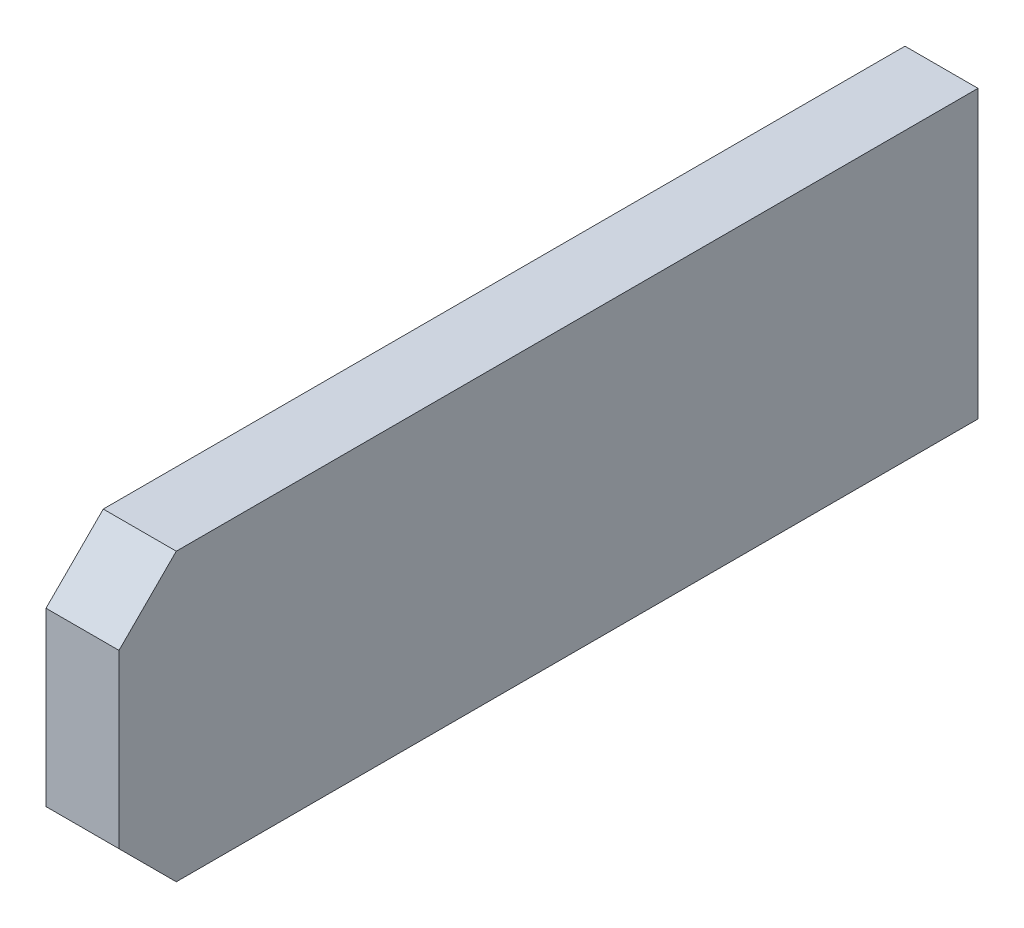
ISO-10303-21;
HEADER;
FILE_DESCRIPTION(('STEP AP214'),'2;1');
FILE_NAME('part.step','',(''),(''),'','','');
FILE_SCHEMA(('AUTOMOTIVE_DESIGN { 1 0 10303 214 1 1 1 1 }'));
ENDSEC;
DATA;
#1=APPLICATION_CONTEXT('core data for automotive mechanical design processes');
#2=APPLICATION_PROTOCOL_DEFINITION('international standard','automotive_design',2000,#1);
#3=PRODUCT_CONTEXT('',#1,'mechanical');
#4=PRODUCT('Part','Part','',(#3));
#5=PRODUCT_RELATED_PRODUCT_CATEGORY('part','',(#4));
#6=PRODUCT_DEFINITION_FORMATION('','',#4);
#7=PRODUCT_DEFINITION_CONTEXT('part definition',#1,'design');
#8=PRODUCT_DEFINITION('design','',#6,#7);
#9=PRODUCT_DEFINITION_SHAPE('','',#8);
#10=(LENGTH_UNIT() NAMED_UNIT(*) SI_UNIT(.MILLI.,.METRE.));
#11=(NAMED_UNIT(*) PLANE_ANGLE_UNIT() SI_UNIT($,.RADIAN.));
#12=(NAMED_UNIT(*) SI_UNIT($,.STERADIAN.) SOLID_ANGLE_UNIT());
#13=UNCERTAINTY_MEASURE_WITH_UNIT(LENGTH_MEASURE(1.E-05),#10,'distance_accuracy_value','');
#14=(GEOMETRIC_REPRESENTATION_CONTEXT(3) GLOBAL_UNCERTAINTY_ASSIGNED_CONTEXT((#13)) GLOBAL_UNIT_ASSIGNED_CONTEXT((#10,
#11,#12)) REPRESENTATION_CONTEXT('',''));
#15=CARTESIAN_POINT('',(0.,0.,0.));
#16=DIRECTION('',(0.,0.,1.));
#17=DIRECTION('',(1.,0.,0.));
#18=AXIS2_PLACEMENT_3D('',#15,#16,#17);
#19=CARTESIAN_POINT('',(44.21957889831,-9.921262189784,6.900000000046));
#20=DIRECTION('',(-1.,0.,0.));
#21=DIRECTION('',(0.,0.,1.));
#22=AXIS2_PLACEMENT_3D('',#19,#20,#21);
#23=PLANE('',#22);
#24=DIRECTION('',(0.,0.707106781179473,-0.707106781193622));
#25=VECTOR('',#24,1.);
#26=CARTESIAN_POINT('',(44.21957889831,-10.12126218978,6.900000000046));
#27=LINE('',#26,#25);
#28=CARTESIAN_POINT('',(44.21957889831,-10.12126218978,6.900000000046));
#29=VERTEX_POINT('',#28);
#30=CARTESIAN_POINT('',(44.21957889831,-9.9212621897835,6.7000000000465));
#31=VERTEX_POINT('',#30);
#32=EDGE_CURVE('E71',#29,#31,#27,.T.);
#33=ORIENTED_EDGE('',*,*,#32,.T.);
#34=DIRECTION('',(0.,0.,-1.));
#35=VECTOR('',#34,1.);
#36=CARTESIAN_POINT('',(44.21957889831,-9.921262189784,6.900000000046));
#37=LINE('',#36,#35);
#38=CARTESIAN_POINT('',(44.21957889831,-9.921262189784,3.900000000046));
#39=VERTEX_POINT('',#38);
#40=EDGE_CURVE('E93',#31,#39,#37,.T.);
#41=ORIENTED_EDGE('',*,*,#40,.T.);
#42=DIRECTION('',(0.,1.,0.));
#43=VECTOR('',#42,1.);
#44=CARTESIAN_POINT('',(44.21957889831,-9.921262189784,3.900000000046));
#45=LINE('',#44,#43);
#46=CARTESIAN_POINT('',(44.21957889831,-10.92126218978,3.900000000046));
#47=VERTEX_POINT('',#46);
#48=EDGE_CURVE('E103',#47,#39,#45,.T.);
#49=ORIENTED_EDGE('',*,*,#48,.F.);
#50=DIRECTION('',(0.,0.,1.));
#51=VECTOR('',#50,1.);
#52=CARTESIAN_POINT('',(44.21957889831,-10.92126218978,8.900000000046));
#53=LINE('',#52,#51);
#54=CARTESIAN_POINT('',(44.21957889831,-10.92126218978,6.700000000046));
#55=VERTEX_POINT('',#54);
#56=EDGE_CURVE('E86',#47,#55,#53,.T.);
#57=ORIENTED_EDGE('',*,*,#56,.T.);
#58=DIRECTION('',(0.,-0.707106781186548,-0.707106781186548));
#59=VECTOR('',#58,1.);
#60=CARTESIAN_POINT('',(44.21957889831,-10.92126218978,6.700000000046));
#61=LINE('',#60,#59);
#62=CARTESIAN_POINT('',(44.21957889831,-10.72126218978,6.900000000046));
#63=VERTEX_POINT('',#62);
#64=EDGE_CURVE('E68',#63,#55,#61,.T.);
#65=ORIENTED_EDGE('',*,*,#64,.F.);
#66=DIRECTION('',(0.,1.,0.));
#67=VECTOR('',#66,1.);
#68=CARTESIAN_POINT('',(44.21957889831,-9.921262189784,6.900000000046));
#69=LINE('',#68,#67);
#70=EDGE_CURVE('E20',#63,#29,#69,.T.);
#71=ORIENTED_EDGE('',*,*,#70,.T.);
#72=EDGE_LOOP('',(#33,#41,#49,#57,#65,#71));
#73=FACE_BOUND('',#72,.T.);
#74=ADVANCED_FACE('F17',(#73),#23,.T.);
#75=CARTESIAN_POINT('',(45.04957889831,-10.92126218978,6.700000000046));
#76=DIRECTION('',(0.,-0.707106781186548,0.707106781186548));
#77=DIRECTION('',(0.,-0.707106781186548,-0.707106781186548));
#78=AXIS2_PLACEMENT_3D('',#75,#76,#77);
#79=PLANE('',#78);
#80=DIRECTION('',(0.,-0.707106781186547,-0.707106781186547));
#81=VECTOR('',#80,1.);
#82=CARTESIAN_POINT('',(44.47457889831,-10.72126218978,6.900000000046));
#83=LINE('',#82,#81);
#84=CARTESIAN_POINT('',(44.47457889831,-10.72126218978,6.900000000046));
#85=VERTEX_POINT('',#84);
#86=CARTESIAN_POINT('',(44.47457889831,-10.92126218978,6.700000000046));
#87=VERTEX_POINT('',#86);
#88=EDGE_CURVE('E82',#85,#87,#83,.T.);
#89=ORIENTED_EDGE('',*,*,#88,.F.);
#90=DIRECTION('',(1.,0.,0.));
#91=VECTOR('',#90,1.);
#92=CARTESIAN_POINT('',(44.56957889831,-10.72126218978,6.900000000046));
#93=LINE('',#92,#91);
#94=EDGE_CURVE('E83',#63,#85,#93,.T.);
#95=ORIENTED_EDGE('',*,*,#94,.F.);
#96=ORIENTED_EDGE('',*,*,#64,.T.);
#97=DIRECTION('',(1.,0.,0.));
#98=VECTOR('',#97,1.);
#99=CARTESIAN_POINT('',(45.04957889831,-10.92126218978,6.700000000046));
#100=LINE('',#99,#98);
#101=EDGE_CURVE('E88',#55,#87,#100,.T.);
#102=ORIENTED_EDGE('',*,*,#101,.T.);
#103=EDGE_LOOP('',(#89,#95,#96,#102));
#104=FACE_BOUND('',#103,.T.);
#105=ADVANCED_FACE('F90',(#104),#79,.T.);
#106=CARTESIAN_POINT('',(45.04957889831,-10.92126218978,8.900000000046));
#107=DIRECTION('',(0.,1.,0.));
#108=DIRECTION('',(0.,0.,1.));
#109=AXIS2_PLACEMENT_3D('',#106,#107,#108);
#110=PLANE('',#109);
#111=DIRECTION('',(-1.,0.,0.));
#112=VECTOR('',#111,1.);
#113=CARTESIAN_POINT('',(44.56957889831,-10.92126218978,3.900000000046));
#114=LINE('',#113,#112);
#115=CARTESIAN_POINT('',(44.47457889831,-10.92126218978,3.900000000046));
#116=VERTEX_POINT('',#115);
#117=EDGE_CURVE('E100',#116,#47,#114,.T.);
#118=ORIENTED_EDGE('',*,*,#117,.F.);
#119=DIRECTION('',(0.,0.,-1.));
#120=VECTOR('',#119,1.);
#121=CARTESIAN_POINT('',(44.47457889831,-10.92126218978,0.));
#122=LINE('',#121,#120);
#123=EDGE_CURVE('E109',#87,#116,#122,.T.);
#124=ORIENTED_EDGE('',*,*,#123,.F.);
#125=ORIENTED_EDGE('',*,*,#101,.F.);
#126=ORIENTED_EDGE('',*,*,#56,.F.);
#127=EDGE_LOOP('',(#118,#124,#125,#126));
#128=FACE_BOUND('',#127,.T.);
#129=ADVANCED_FACE('F110',(#128),#110,.F.);
#130=CARTESIAN_POINT('',(44.56957889831,-9.921262189784,3.900000000046));
#131=DIRECTION('',(0.,0.,-1.));
#132=DIRECTION('',(-1.,0.,0.));
#133=AXIS2_PLACEMENT_3D('',#130,#131,#132);
#134=PLANE('',#133);
#135=DIRECTION('',(0.,1.,0.));
#136=VECTOR('',#135,1.);
#137=CARTESIAN_POINT('',(44.47457889831,0.,3.900000000046));
#138=LINE('',#137,#136);
#139=CARTESIAN_POINT('',(44.47457889831,-9.921262189784,3.900000000046));
#140=VERTEX_POINT('',#139);
#141=EDGE_CURVE('E114',#116,#140,#138,.T.);
#142=ORIENTED_EDGE('',*,*,#141,.F.);
#143=ORIENTED_EDGE('',*,*,#117,.T.);
#144=ORIENTED_EDGE('',*,*,#48,.T.);
#145=DIRECTION('',(1.,0.,0.));
#146=VECTOR('',#145,1.);
#147=CARTESIAN_POINT('',(44.21957889831,-9.921262189784,3.900000000046));
#148=LINE('',#147,#146);
#149=EDGE_CURVE('E98',#39,#140,#148,.T.);
#150=ORIENTED_EDGE('',*,*,#149,.T.);
#151=EDGE_LOOP('',(#142,#143,#144,#150));
#152=FACE_BOUND('',#151,.T.);
#153=ADVANCED_FACE('F127',(#152),#134,.T.);
#154=CARTESIAN_POINT('',(44.21957889831,-9.921262189784,6.900000000046));
#155=DIRECTION('',(0.,-1.,0.));
#156=DIRECTION('',(0.,0.,-1.));
#157=AXIS2_PLACEMENT_3D('',#154,#155,#156);
#158=PLANE('',#157);
#159=DIRECTION('',(1.,0.,0.));
#160=VECTOR('',#159,1.);
#161=CARTESIAN_POINT('',(44.56957889831,-9.921262189782,6.700000000048));
#162=LINE('',#161,#160);
#163=CARTESIAN_POINT('',(44.47457889831,-9.9212621897835,6.7000000000465));
#164=VERTEX_POINT('',#163);
#165=EDGE_CURVE('E73',#164,#31,#162,.F.);
#166=ORIENTED_EDGE('',*,*,#165,.F.);
#167=DIRECTION('',(0.,0.,-1.));
#168=VECTOR('',#167,1.);
#169=CARTESIAN_POINT('',(44.47457889831,-9.921262189784,0.));
#170=LINE('',#169,#168);
#171=EDGE_CURVE('E119',#140,#164,#170,.F.);
#172=ORIENTED_EDGE('',*,*,#171,.F.);
#173=ORIENTED_EDGE('',*,*,#149,.F.);
#174=ORIENTED_EDGE('',*,*,#40,.F.);
#175=EDGE_LOOP('',(#166,#172,#173,#174));
#176=FACE_BOUND('',#175,.T.);
#177=ADVANCED_FACE('F125',(#176),#158,.F.);
#178=CARTESIAN_POINT('',(44.56957889831,-10.12126218978,6.900000000046));
#179=DIRECTION('',(0.,0.707106781186548,0.707106781186548));
#180=DIRECTION('',(0.,-0.707106781186548,0.707106781186548));
#181=AXIS2_PLACEMENT_3D('',#178,#179,#180);
#182=PLANE('',#181);
#183=DIRECTION('',(0.,-0.707106781179473,0.707106781193622));
#184=VECTOR('',#183,1.);
#185=CARTESIAN_POINT('',(44.47457889831,-9.921262189784,6.700000000046));
#186=LINE('',#185,#184);
#187=CARTESIAN_POINT('',(44.47457889831,-10.12126218978,6.900000000046));
#188=VERTEX_POINT('',#187);
#189=EDGE_CURVE('E26',#164,#188,#186,.T.);
#190=ORIENTED_EDGE('',*,*,#189,.F.);
#191=ORIENTED_EDGE('',*,*,#165,.T.);
#192=ORIENTED_EDGE('',*,*,#32,.F.);
#193=DIRECTION('',(1.,0.,0.));
#194=VECTOR('',#193,1.);
#195=CARTESIAN_POINT('',(44.56957889831,-10.12126218978,6.900000000046));
#196=LINE('',#195,#194);
#197=EDGE_CURVE('E35',#188,#29,#196,.F.);
#198=ORIENTED_EDGE('',*,*,#197,.F.);
#199=EDGE_LOOP('',(#190,#191,#192,#198));
#200=FACE_BOUND('',#199,.T.);
#201=ADVANCED_FACE('F72',(#200),#182,.T.);
#202=CARTESIAN_POINT('',(44.56957889831,-9.921262189784,6.900000000046));
#203=DIRECTION('',(0.,0.,1.));
#204=DIRECTION('',(1.,0.,0.));
#205=AXIS2_PLACEMENT_3D('',#202,#203,#204);
#206=PLANE('',#205);
#207=DIRECTION('',(0.,1.,0.));
#208=VECTOR('',#207,1.);
#209=CARTESIAN_POINT('',(44.47457889831,0.,6.900000000046));
#210=LINE('',#209,#208);
#211=EDGE_CURVE('E11',#188,#85,#210,.F.);
#212=ORIENTED_EDGE('',*,*,#211,.F.);
#213=ORIENTED_EDGE('',*,*,#197,.T.);
#214=ORIENTED_EDGE('',*,*,#70,.F.);
#215=ORIENTED_EDGE('',*,*,#94,.T.);
#216=EDGE_LOOP('',(#212,#213,#214,#215));
#217=FACE_BOUND('',#216,.T.);
#218=ADVANCED_FACE('F79',(#217),#206,.T.);
#219=CARTESIAN_POINT('',(44.47457889831,0.,0.));
#220=DIRECTION('',(1.,0.,0.));
#221=DIRECTION('',(0.,0.,-1.));
#222=AXIS2_PLACEMENT_3D('',#219,#220,#221);
#223=PLANE('',#222);
#224=ORIENTED_EDGE('',*,*,#189,.T.);
#225=ORIENTED_EDGE('',*,*,#211,.T.);
#226=ORIENTED_EDGE('',*,*,#88,.T.);
#227=ORIENTED_EDGE('',*,*,#123,.T.);
#228=ORIENTED_EDGE('',*,*,#141,.T.);
#229=ORIENTED_EDGE('',*,*,#171,.T.);
#230=EDGE_LOOP('',(#224,#225,#226,#227,#228,#229));
#231=FACE_BOUND('',#230,.T.);
#232=ADVANCED_FACE('F116',(#231),#223,.T.);
#233=CLOSED_SHELL('',(#74,#105,#129,#153,#177,#201,#218,#232));
#234=MANIFOLD_SOLID_BREP('B1',#233);
#235=ADVANCED_BREP_SHAPE_REPRESENTATION('',(#18,#234),#14);
#236=SHAPE_DEFINITION_REPRESENTATION(#9,#235);
ENDSEC;
END-ISO-10303-21;
